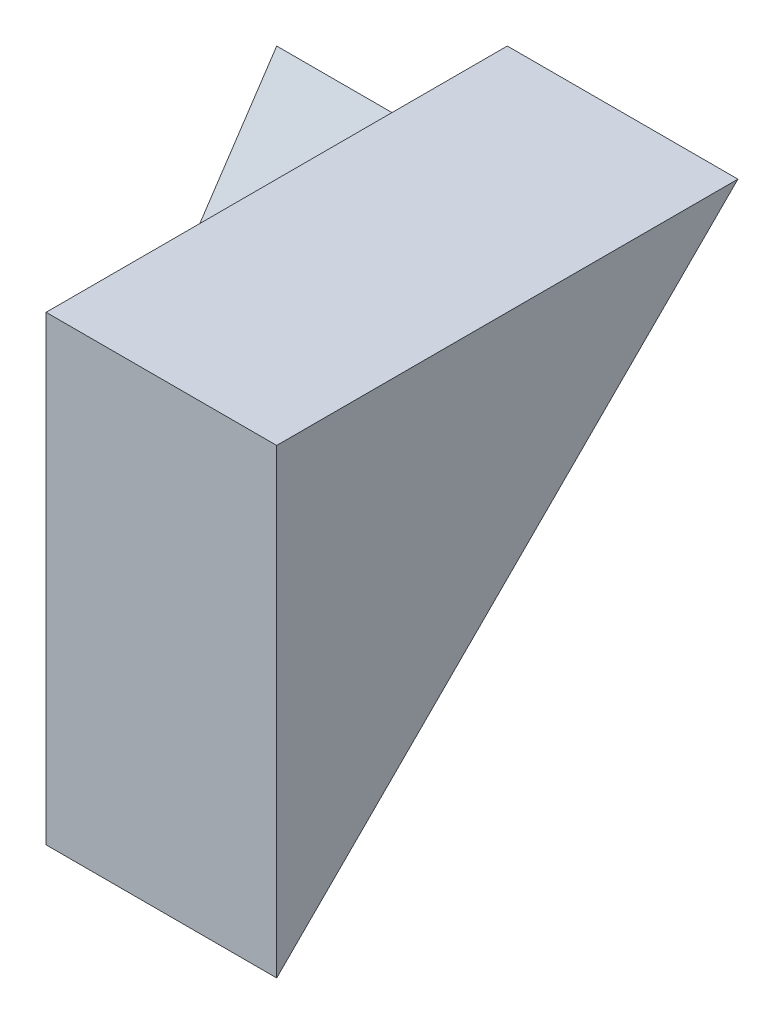
ISO-10303-21;
HEADER;
FILE_DESCRIPTION(('STEP AP214'),'2;1');
FILE_NAME('part.step','',(''),(''),'','','');
FILE_SCHEMA(('AUTOMOTIVE_DESIGN { 1 0 10303 214 1 1 1 1 }'));
ENDSEC;
DATA;
#1=APPLICATION_CONTEXT('core data for automotive mechanical design processes');
#2=APPLICATION_PROTOCOL_DEFINITION('international standard','automotive_design',2000,#1);
#3=PRODUCT_CONTEXT('',#1,'mechanical');
#4=PRODUCT('Part','Part','',(#3));
#5=PRODUCT_RELATED_PRODUCT_CATEGORY('part','',(#4));
#6=PRODUCT_DEFINITION_FORMATION('','',#4);
#7=PRODUCT_DEFINITION_CONTEXT('part definition',#1,'design');
#8=PRODUCT_DEFINITION('design','',#6,#7);
#9=PRODUCT_DEFINITION_SHAPE('','',#8);
#10=(LENGTH_UNIT() NAMED_UNIT(*) SI_UNIT(.MILLI.,.METRE.));
#11=(NAMED_UNIT(*) PLANE_ANGLE_UNIT() SI_UNIT($,.RADIAN.));
#12=(NAMED_UNIT(*) SI_UNIT($,.STERADIAN.) SOLID_ANGLE_UNIT());
#13=UNCERTAINTY_MEASURE_WITH_UNIT(LENGTH_MEASURE(1.E-05),#10,'distance_accuracy_value','');
#14=(GEOMETRIC_REPRESENTATION_CONTEXT(3) GLOBAL_UNCERTAINTY_ASSIGNED_CONTEXT((#13)) GLOBAL_UNIT_ASSIGNED_CONTEXT((#10,
#11,#12)) REPRESENTATION_CONTEXT('',''));
#15=CARTESIAN_POINT('',(0.,0.,0.));
#16=DIRECTION('',(0.,0.,1.));
#17=DIRECTION('',(1.,0.,0.));
#18=AXIS2_PLACEMENT_3D('',#15,#16,#17);
#19=CARTESIAN_POINT('',(2.,0.,0.));
#20=DIRECTION('',(0.,1.,0.));
#21=DIRECTION('',(0.,0.,1.));
#22=AXIS2_PLACEMENT_3D('',#19,#20,#21);
#23=PLANE('',#22);
#24=DIRECTION('',(0.,0.,-1.));
#25=VECTOR('',#24,1.);
#26=CARTESIAN_POINT('',(0.,0.,0.));
#27=LINE('',#26,#25);
#28=CARTESIAN_POINT('',(0.,0.,-2.));
#29=VERTEX_POINT('',#28);
#30=CARTESIAN_POINT('',(0.,0.,-4.));
#31=VERTEX_POINT('',#30);
#32=EDGE_CURVE('E52',#29,#31,#27,.T.);
#33=ORIENTED_EDGE('',*,*,#32,.F.);
#34=DIRECTION('',(1.,0.,0.));
#35=VECTOR('',#34,1.);
#36=CARTESIAN_POINT('',(-2.,0.,-2.));
#37=LINE('',#36,#35);
#38=CARTESIAN_POINT('',(-2.,0.,-2.));
#39=VERTEX_POINT('',#38);
#40=EDGE_CURVE('E90',#39,#29,#37,.T.);
#41=ORIENTED_EDGE('',*,*,#40,.F.);
#42=DIRECTION('',(0.,0.,1.));
#43=VECTOR('',#42,1.);
#44=CARTESIAN_POINT('',(-2.,0.,-4.));
#45=LINE('',#44,#43);
#46=CARTESIAN_POINT('',(-2.,0.,-4.));
#47=VERTEX_POINT('',#46);
#48=EDGE_CURVE('E88',#47,#39,#45,.T.);
#49=ORIENTED_EDGE('',*,*,#48,.F.);
#50=DIRECTION('',(-1.,0.,0.));
#51=VECTOR('',#50,1.);
#52=CARTESIAN_POINT('',(2.,0.,-4.));
#53=LINE('',#52,#51);
#54=EDGE_CURVE('E79',#31,#47,#53,.T.);
#55=ORIENTED_EDGE('',*,*,#54,.F.);
#56=EDGE_LOOP('',(#33,#41,#49,#55));
#57=FACE_BOUND('',#56,.T.);
#58=ADVANCED_FACE('F42',(#57),#23,.F.);
#59=CARTESIAN_POINT('',(2.,0.,-4.));
#60=DIRECTION('',(0.,0.,1.));
#61=DIRECTION('',(1.,0.,0.));
#62=AXIS2_PLACEMENT_3D('',#59,#60,#61);
#63=PLANE('',#62);
#64=DIRECTION('',(0.,1.,0.));
#65=VECTOR('',#64,1.);
#66=CARTESIAN_POINT('',(0.,0.,-4.));
#67=LINE('',#66,#65);
#68=CARTESIAN_POINT('',(0.,3.,-4.));
#69=VERTEX_POINT('',#68);
#70=EDGE_CURVE('E12',#31,#69,#67,.T.);
#71=ORIENTED_EDGE('',*,*,#70,.F.);
#72=ORIENTED_EDGE('',*,*,#54,.T.);
#73=DIRECTION('',(0.,-1.,0.));
#74=VECTOR('',#73,1.);
#75=CARTESIAN_POINT('',(-2.,0.,-4.));
#76=LINE('',#75,#74);
#77=CARTESIAN_POINT('',(-2.,3.,-4.));
#78=VERTEX_POINT('',#77);
#79=EDGE_CURVE('E83',#78,#47,#76,.T.);
#80=ORIENTED_EDGE('',*,*,#79,.F.);
#81=DIRECTION('',(1.,0.,0.));
#82=VECTOR('',#81,1.);
#83=CARTESIAN_POINT('',(-2.,3.,-4.));
#84=LINE('',#83,#82);
#85=EDGE_CURVE('E72',#78,#69,#84,.T.);
#86=ORIENTED_EDGE('',*,*,#85,.T.);
#87=EDGE_LOOP('',(#71,#72,#80,#86));
#88=FACE_BOUND('',#87,.T.);
#89=ADVANCED_FACE('F81',(#88),#63,.F.);
#90=CARTESIAN_POINT('',(-2.,0.,0.));
#91=DIRECTION('',(1.,0.,0.));
#92=DIRECTION('',(0.,0.,-1.));
#93=AXIS2_PLACEMENT_3D('',#90,#91,#92);
#94=PLANE('',#93);
#95=ORIENTED_EDGE('',*,*,#48,.T.);
#96=DIRECTION('',(0.,-0.832050294337844,0.554700196225229));
#97=VECTOR('',#96,1.);
#98=CARTESIAN_POINT('',(-2.,0.,-2.));
#99=LINE('',#98,#97);
#100=EDGE_CURVE('E94',#78,#39,#99,.T.);
#101=ORIENTED_EDGE('',*,*,#100,.F.);
#102=ORIENTED_EDGE('',*,*,#79,.T.);
#103=EDGE_LOOP('',(#95,#101,#102));
#104=FACE_BOUND('',#103,.T.);
#105=ADVANCED_FACE('F93',(#104),#94,.F.);
#106=CARTESIAN_POINT('',(0.,0.,-2.));
#107=DIRECTION('',(0.,-0.554700196225229,-0.832050294337844));
#108=DIRECTION('',(0.,0.832050294337844,-0.554700196225229));
#109=AXIS2_PLACEMENT_3D('',#106,#107,#108);
#110=PLANE('',#109);
#111=ORIENTED_EDGE('',*,*,#100,.T.);
#112=ORIENTED_EDGE('',*,*,#40,.T.);
#113=DIRECTION('',(0.,-0.832050294337844,0.554700196225229));
#114=VECTOR('',#113,1.);
#115=CARTESIAN_POINT('',(0.,0.,-2.));
#116=LINE('',#115,#114);
#117=EDGE_CURVE('E65',#69,#29,#116,.T.);
#118=ORIENTED_EDGE('',*,*,#117,.F.);
#119=ORIENTED_EDGE('',*,*,#85,.F.);
#120=EDGE_LOOP('',(#111,#112,#118,#119));
#121=FACE_BOUND('',#120,.T.);
#122=ADVANCED_FACE('F108',(#121),#110,.F.);
#123=CARTESIAN_POINT('',(0.,0.,0.));
#124=DIRECTION('',(1.,0.,0.));
#125=DIRECTION('',(0.,0.,-1.));
#126=AXIS2_PLACEMENT_3D('',#123,#124,#125);
#127=PLANE('',#126);
#128=ORIENTED_EDGE('',*,*,#117,.T.);
#129=ORIENTED_EDGE('',*,*,#32,.T.);
#130=ORIENTED_EDGE('',*,*,#70,.T.);
#131=EDGE_LOOP('',(#128,#129,#130));
#132=FACE_BOUND('',#131,.T.);
#133=ADVANCED_FACE('F44',(#132),#127,.T.);
#134=CLOSED_SHELL('',(#58,#89,#105,#122,#133));
#135=MANIFOLD_SOLID_BREP('B2',#134);
#136=CARTESIAN_POINT('',(2.,0.,0.));
#137=DIRECTION('',(-1.,0.,0.));
#138=DIRECTION('',(0.,0.,1.));
#139=AXIS2_PLACEMENT_3D('',#136,#137,#138);
#140=PLANE('',#139);
#141=DIRECTION('',(0.,-1.,0.));
#142=VECTOR('',#141,1.);
#143=CARTESIAN_POINT('',(2.,0.,0.));
#144=LINE('',#143,#142);
#145=CARTESIAN_POINT('',(2.,4.,0.));
#146=VERTEX_POINT('',#145);
#147=CARTESIAN_POINT('',(2.,0.,0.));
#148=VERTEX_POINT('',#147);
#149=EDGE_CURVE('E196',#146,#148,#144,.T.);
#150=ORIENTED_EDGE('',*,*,#149,.T.);
#151=DIRECTION('',(0.,-0.707106781186548,0.707106781186548));
#152=VECTOR('',#151,1.);
#153=CARTESIAN_POINT('',(2.,0.,0.));
#154=LINE('',#153,#152);
#155=CARTESIAN_POINT('',(2.,4.,-4.));
#156=VERTEX_POINT('',#155);
#157=EDGE_CURVE('E191',#156,#148,#154,.T.);
#158=ORIENTED_EDGE('',*,*,#157,.F.);
#159=DIRECTION('',(0.,0.,1.));
#160=VECTOR('',#159,1.);
#161=CARTESIAN_POINT('',(2.,4.,0.));
#162=LINE('',#161,#160);
#163=EDGE_CURVE('E172',#156,#146,#162,.T.);
#164=ORIENTED_EDGE('',*,*,#163,.T.);
#165=EDGE_LOOP('',(#150,#158,#164));
#166=FACE_BOUND('',#165,.T.);
#167=ADVANCED_FACE('F156',(#166),#140,.F.);
#168=CARTESIAN_POINT('',(0.,0.,0.));
#169=DIRECTION('',(-1.,0.,0.));
#170=DIRECTION('',(0.,0.,1.));
#171=AXIS2_PLACEMENT_3D('',#168,#169,#170);
#172=PLANE('',#171);
#173=DIRECTION('',(0.,-0.707106781186548,0.707106781186548));
#174=VECTOR('',#173,1.);
#175=CARTESIAN_POINT('',(0.,0.,0.));
#176=LINE('',#175,#174);
#177=CARTESIAN_POINT('',(0.,4.,-4.));
#178=VERTEX_POINT('',#177);
#179=CARTESIAN_POINT('',(0.,0.,0.));
#180=VERTEX_POINT('',#179);
#181=EDGE_CURVE('E187',#178,#180,#176,.T.);
#182=ORIENTED_EDGE('',*,*,#181,.T.);
#183=DIRECTION('',(0.,-1.,0.));
#184=VECTOR('',#183,1.);
#185=CARTESIAN_POINT('',(0.,0.,0.));
#186=LINE('',#185,#184);
#187=CARTESIAN_POINT('',(0.,4.,0.));
#188=VERTEX_POINT('',#187);
#189=EDGE_CURVE('E205',#188,#180,#186,.T.);
#190=ORIENTED_EDGE('',*,*,#189,.F.);
#191=DIRECTION('',(0.,0.,1.));
#192=VECTOR('',#191,1.);
#193=CARTESIAN_POINT('',(0.,4.,0.));
#194=LINE('',#193,#192);
#195=EDGE_CURVE('E202',#178,#188,#194,.T.);
#196=ORIENTED_EDGE('',*,*,#195,.F.);
#197=EDGE_LOOP('',(#182,#190,#196));
#198=FACE_BOUND('',#197,.T.);
#199=ADVANCED_FACE('F211',(#198),#172,.T.);
#200=CARTESIAN_POINT('',(2.,4.,0.));
#201=DIRECTION('',(0.,-1.,0.));
#202=DIRECTION('',(0.,0.,-1.));
#203=AXIS2_PLACEMENT_3D('',#200,#201,#202);
#204=PLANE('',#203);
#205=ORIENTED_EDGE('',*,*,#195,.T.);
#206=DIRECTION('',(-1.,0.,0.));
#207=VECTOR('',#206,1.);
#208=CARTESIAN_POINT('',(2.,4.,0.));
#209=LINE('',#208,#207);
#210=EDGE_CURVE('E194',#146,#188,#209,.T.);
#211=ORIENTED_EDGE('',*,*,#210,.F.);
#212=ORIENTED_EDGE('',*,*,#163,.F.);
#213=DIRECTION('',(-1.,0.,0.));
#214=VECTOR('',#213,1.);
#215=CARTESIAN_POINT('',(2.,4.,-4.));
#216=LINE('',#215,#214);
#217=EDGE_CURVE('E165',#156,#178,#216,.T.);
#218=ORIENTED_EDGE('',*,*,#217,.T.);
#219=EDGE_LOOP('',(#205,#211,#212,#218));
#220=FACE_BOUND('',#219,.T.);
#221=ADVANCED_FACE('F198',(#220),#204,.F.);
#222=CARTESIAN_POINT('',(2.,0.,0.));
#223=DIRECTION('',(0.,0.,-1.));
#224=DIRECTION('',(-1.,0.,0.));
#225=AXIS2_PLACEMENT_3D('',#222,#223,#224);
#226=PLANE('',#225);
#227=ORIENTED_EDGE('',*,*,#189,.T.);
#228=DIRECTION('',(-1.,0.,0.));
#229=VECTOR('',#228,1.);
#230=CARTESIAN_POINT('',(2.,0.,0.));
#231=LINE('',#230,#229);
#232=EDGE_CURVE('E40',#148,#180,#231,.T.);
#233=ORIENTED_EDGE('',*,*,#232,.F.);
#234=ORIENTED_EDGE('',*,*,#149,.F.);
#235=ORIENTED_EDGE('',*,*,#210,.T.);
#236=EDGE_LOOP('',(#227,#233,#234,#235));
#237=FACE_BOUND('',#236,.T.);
#238=ADVANCED_FACE('F158',(#237),#226,.F.);
#239=CARTESIAN_POINT('',(0.,0.,0.));
#240=DIRECTION('',(0.,0.707106781186547,0.707106781186547));
#241=DIRECTION('',(0.,-0.707106781186548,0.707106781186548));
#242=AXIS2_PLACEMENT_3D('',#239,#240,#241);
#243=PLANE('',#242);
#244=ORIENTED_EDGE('',*,*,#157,.T.);
#245=ORIENTED_EDGE('',*,*,#232,.T.);
#246=ORIENTED_EDGE('',*,*,#181,.F.);
#247=ORIENTED_EDGE('',*,*,#217,.F.);
#248=EDGE_LOOP('',(#244,#245,#246,#247));
#249=FACE_BOUND('',#248,.T.);
#250=ADVANCED_FACE('F190',(#249),#243,.F.);
#251=CLOSED_SHELL('',(#167,#199,#221,#238,#250));
#252=MANIFOLD_SOLID_BREP('B6',#251);
#253=ADVANCED_BREP_SHAPE_REPRESENTATION('',(#18,#135,#252),#14);
#254=SHAPE_DEFINITION_REPRESENTATION(#9,#253);
ENDSEC;
END-ISO-10303-21;
